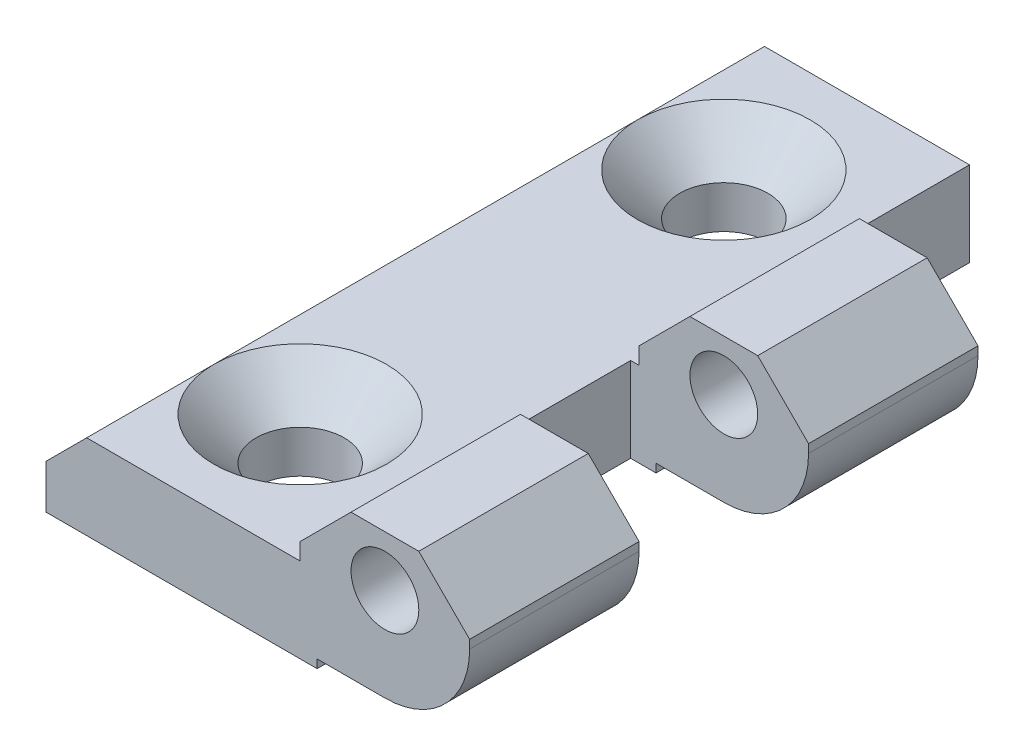
ISO-10303-21;
HEADER;
FILE_DESCRIPTION(('STEP AP214'),'2;1');
FILE_NAME('part.step','',(''),(''),'','','');
FILE_SCHEMA(('AUTOMOTIVE_DESIGN { 1 0 10303 214 1 1 1 1 }'));
ENDSEC;
DATA;
#1=APPLICATION_CONTEXT('core data for automotive mechanical design processes');
#2=APPLICATION_PROTOCOL_DEFINITION('international standard','automotive_design',2000,#1);
#3=PRODUCT_CONTEXT('',#1,'mechanical');
#4=PRODUCT('Part','Part','',(#3));
#5=PRODUCT_RELATED_PRODUCT_CATEGORY('part','',(#4));
#6=PRODUCT_DEFINITION_FORMATION('','',#4);
#7=PRODUCT_DEFINITION_CONTEXT('part definition',#1,'design');
#8=PRODUCT_DEFINITION('design','',#6,#7);
#9=PRODUCT_DEFINITION_SHAPE('','',#8);
#10=(LENGTH_UNIT() NAMED_UNIT(*) SI_UNIT(.MILLI.,.METRE.));
#11=(NAMED_UNIT(*) PLANE_ANGLE_UNIT() SI_UNIT($,.RADIAN.));
#12=(NAMED_UNIT(*) SI_UNIT($,.STERADIAN.) SOLID_ANGLE_UNIT());
#13=UNCERTAINTY_MEASURE_WITH_UNIT(LENGTH_MEASURE(1.E-05),#10,'distance_accuracy_value','');
#14=(GEOMETRIC_REPRESENTATION_CONTEXT(3) GLOBAL_UNCERTAINTY_ASSIGNED_CONTEXT((#13)) GLOBAL_UNIT_ASSIGNED_CONTEXT((#10,
#11,#12)) REPRESENTATION_CONTEXT('',''));
#15=CARTESIAN_POINT('',(0.,0.,0.));
#16=DIRECTION('',(0.,0.,1.));
#17=DIRECTION('',(1.,0.,0.));
#18=AXIS2_PLACEMENT_3D('',#15,#16,#17);
#19=CARTESIAN_POINT('',(-15.4752336448598,-9.99670301142266,40.));
#20=DIRECTION('',(-1.,0.,0.));
#21=DIRECTION('',(0.,-1.,0.));
#22=AXIS2_PLACEMENT_3D('',#19,#20,#21);
#23=PLANE('',#22);
#24=DIRECTION('',(0.,0.,-1.));
#25=VECTOR('',#24,1.);
#26=CARTESIAN_POINT('',(-15.4752336448598,-9.49670301142266,40.));
#27=LINE('',#26,#25);
#28=CARTESIAN_POINT('',(-15.4752336448598,-9.49670301142266,20.));
#29=VERTEX_POINT('',#28);
#30=CARTESIAN_POINT('',(-15.4752336448598,-9.49670301142266,9.99999999999999));
#31=VERTEX_POINT('',#30);
#32=EDGE_CURVE('E395',#29,#31,#27,.T.);
#33=ORIENTED_EDGE('',*,*,#32,.F.);
#34=DIRECTION('',(0.,-1.,0.));
#35=VECTOR('',#34,1.);
#36=CARTESIAN_POINT('',(-15.4752336448598,-9.99670301142266,20.));
#37=LINE('',#36,#35);
#38=CARTESIAN_POINT('',(-15.4752336448598,-9.99670301142276,20.));
#39=VERTEX_POINT('',#38);
#40=EDGE_CURVE('E278',#29,#39,#37,.T.);
#41=ORIENTED_EDGE('',*,*,#40,.T.);
#42=DIRECTION('',(0.,0.,-1.));
#43=VECTOR('',#42,1.);
#44=CARTESIAN_POINT('',(-15.4752336448598,-9.99670301142266,40.));
#45=LINE('',#44,#43);
#46=CARTESIAN_POINT('',(-15.4752336448598,-9.99670301142276,9.99999999999999));
#47=VERTEX_POINT('',#46);
#48=EDGE_CURVE('E399',#39,#47,#45,.T.);
#49=ORIENTED_EDGE('',*,*,#48,.T.);
#50=DIRECTION('',(0.,1.,0.));
#51=VECTOR('',#50,1.);
#52=CARTESIAN_POINT('',(-15.4752336448598,-9.99670301142266,9.99999999999999));
#53=LINE('',#52,#51);
#54=EDGE_CURVE('E317',#47,#31,#53,.T.);
#55=ORIENTED_EDGE('',*,*,#54,.T.);
#56=EDGE_LOOP('',(#33,#41,#49,#55));
#57=FACE_BOUND('',#56,.T.);
#58=ADVANCED_FACE('F33',(#57),#23,.F.);
#59=CARTESIAN_POINT('',(-15.4752336448598,-9.49670301142266,40.));
#60=DIRECTION('',(0.,1.,0.));
#61=DIRECTION('',(-1.,0.,0.));
#62=AXIS2_PLACEMENT_3D('',#59,#60,#61);
#63=PLANE('',#62);
#64=DIRECTION('',(0.,0.,-1.));
#65=VECTOR('',#64,1.);
#66=CARTESIAN_POINT('',(-11.4752336448598,-9.49670301142264,40.));
#67=LINE('',#66,#65);
#68=CARTESIAN_POINT('',(-11.4752336448598,-9.49670301142264,20.));
#69=VERTEX_POINT('',#68);
#70=CARTESIAN_POINT('',(-11.4752336448598,-9.49670301142264,9.99999999999999));
#71=VERTEX_POINT('',#70);
#72=EDGE_CURVE('E391',#69,#71,#67,.T.);
#73=ORIENTED_EDGE('',*,*,#72,.F.);
#74=DIRECTION('',(-1.,0.,0.));
#75=VECTOR('',#74,1.);
#76=CARTESIAN_POINT('',(-15.4752336448598,-9.49670301142266,20.));
#77=LINE('',#76,#75);
#78=EDGE_CURVE('E275',#69,#29,#77,.T.);
#79=ORIENTED_EDGE('',*,*,#78,.T.);
#80=ORIENTED_EDGE('',*,*,#32,.T.);
#81=DIRECTION('',(1.,0.,0.));
#82=VECTOR('',#81,1.);
#83=CARTESIAN_POINT('',(-15.4752336448598,-9.49670301142266,9.99999999999999));
#84=LINE('',#83,#82);
#85=EDGE_CURVE('E314',#31,#71,#84,.T.);
#86=ORIENTED_EDGE('',*,*,#85,.T.);
#87=EDGE_LOOP('',(#73,#79,#80,#86));
#88=FACE_BOUND('',#87,.T.);
#89=ADVANCED_FACE('F471',(#88),#63,.F.);
#90=CARTESIAN_POINT('',(-11.4752336448598,-4.49670301142263,40.));
#91=DIRECTION('',(0.,0.,-1.));
#92=DIRECTION('',(-1.,0.,0.));
#93=AXIS2_PLACEMENT_3D('',#90,#91,#92);
#94=CYLINDRICAL_SURFACE('',#93,5.00000000000002);
#95=DIRECTION('',(0.,0.,-1.));
#96=VECTOR('',#95,1.);
#97=CARTESIAN_POINT('',(-6.47523364485978,-4.49670301142256,40.));
#98=LINE('',#97,#96);
#99=CARTESIAN_POINT('',(-6.47523364485978,-4.49670301142256,20.));
#100=VERTEX_POINT('',#99);
#101=CARTESIAN_POINT('',(-6.47523364485978,-4.49670301142256,9.99999999999999));
#102=VERTEX_POINT('',#101);
#103=EDGE_CURVE('E387',#100,#102,#98,.T.);
#104=ORIENTED_EDGE('',*,*,#103,.F.);
#105=CARTESIAN_POINT('',(-11.4752336448598,-4.49670301142263,20.));
#106=DIRECTION('',(0.,0.,-1.));
#107=DIRECTION('',(-1.,0.,0.));
#108=AXIS2_PLACEMENT_3D('',#105,#106,#107);
#109=CIRCLE('',#108,5.00000000000002);
#110=EDGE_CURVE('E272',#100,#69,#109,.T.);
#111=ORIENTED_EDGE('',*,*,#110,.T.);
#112=ORIENTED_EDGE('',*,*,#72,.T.);
#113=CARTESIAN_POINT('',(-11.4752336448598,-4.49670301142263,9.99999999999999));
#114=DIRECTION('',(0.,0.,1.));
#115=DIRECTION('',(1.,0.,0.));
#116=AXIS2_PLACEMENT_3D('',#113,#114,#115);
#117=CIRCLE('',#116,5.00000000000002);
#118=EDGE_CURVE('E311',#71,#102,#117,.T.);
#119=ORIENTED_EDGE('',*,*,#118,.T.);
#120=EDGE_LOOP('',(#104,#111,#112,#119));
#121=FACE_BOUND('',#120,.T.);
#122=ADVANCED_FACE('F468',(#121),#94,.T.);
#123=CARTESIAN_POINT('',(-6.47523364485978,-4.49670301142256,40.));
#124=DIRECTION('',(-1.,0.,0.));
#125=DIRECTION('',(0.,-1.,0.));
#126=AXIS2_PLACEMENT_3D('',#123,#124,#125);
#127=PLANE('',#126);
#128=DIRECTION('',(0.,0.,-1.));
#129=VECTOR('',#128,1.);
#130=CARTESIAN_POINT('',(-6.47523364485978,-3.99670301142262,40.));
#131=LINE('',#130,#129);
#132=CARTESIAN_POINT('',(-6.47523364485978,-3.99670301142262,20.));
#133=VERTEX_POINT('',#132);
#134=CARTESIAN_POINT('',(-6.47523364485978,-3.99670301142262,9.99999999999999));
#135=VERTEX_POINT('',#134);
#136=EDGE_CURVE('E383',#133,#135,#131,.T.);
#137=ORIENTED_EDGE('',*,*,#136,.F.);
#138=DIRECTION('',(0.,-1.,0.));
#139=VECTOR('',#138,1.);
#140=CARTESIAN_POINT('',(-6.47523364485978,-4.49670301142256,20.));
#141=LINE('',#140,#139);
#142=EDGE_CURVE('E269',#133,#100,#141,.T.);
#143=ORIENTED_EDGE('',*,*,#142,.T.);
#144=ORIENTED_EDGE('',*,*,#103,.T.);
#145=DIRECTION('',(0.,1.,0.));
#146=VECTOR('',#145,1.);
#147=CARTESIAN_POINT('',(-6.47523364485978,-4.49670301142256,9.99999999999999));
#148=LINE('',#147,#146);
#149=EDGE_CURVE('E308',#102,#135,#148,.T.);
#150=ORIENTED_EDGE('',*,*,#149,.T.);
#151=EDGE_LOOP('',(#137,#143,#144,#150));
#152=FACE_BOUND('',#151,.T.);
#153=ADVANCED_FACE('F465',(#152),#127,.F.);
#154=CARTESIAN_POINT('',(-6.47523364485978,-3.99670301142262,40.));
#155=DIRECTION('',(-0.707106781186545,-0.70710678118655,0.));
#156=DIRECTION('',(0.70710678118655,-0.707106781186545,0.));
#157=AXIS2_PLACEMENT_3D('',#154,#155,#156);
#158=PLANE('',#157);
#159=DIRECTION('',(0.,0.,-1.));
#160=VECTOR('',#159,1.);
#161=CARTESIAN_POINT('',(-9.47523364485979,-0.996703011422631,40.));
#162=LINE('',#161,#160);
#163=CARTESIAN_POINT('',(-9.47523364485979,-0.996703011422568,20.));
#164=VERTEX_POINT('',#163);
#165=CARTESIAN_POINT('',(-9.47523364485979,-0.996703011422568,9.99999999999999));
#166=VERTEX_POINT('',#165);
#167=EDGE_CURVE('E379',#164,#166,#162,.T.);
#168=ORIENTED_EDGE('',*,*,#167,.F.);
#169=DIRECTION('',(0.70710678118655,-0.707106781186545,0.));
#170=VECTOR('',#169,1.);
#171=CARTESIAN_POINT('',(-6.47523364485978,-3.99670301142262,20.));
#172=LINE('',#171,#170);
#173=EDGE_CURVE('E266',#164,#133,#172,.T.);
#174=ORIENTED_EDGE('',*,*,#173,.T.);
#175=ORIENTED_EDGE('',*,*,#136,.T.);
#176=DIRECTION('',(-0.70710678118655,0.707106781186545,0.));
#177=VECTOR('',#176,1.);
#178=CARTESIAN_POINT('',(-6.47523364485978,-3.99670301142262,9.99999999999999));
#179=LINE('',#178,#177);
#180=EDGE_CURVE('E305',#135,#166,#179,.T.);
#181=ORIENTED_EDGE('',*,*,#180,.T.);
#182=EDGE_LOOP('',(#168,#174,#175,#181));
#183=FACE_BOUND('',#182,.T.);
#184=ADVANCED_FACE('F460',(#183),#158,.F.);
#185=CARTESIAN_POINT('',(-9.47523364485979,-0.996703011422631,40.));
#186=DIRECTION('',(0.,-1.,0.));
#187=DIRECTION('',(1.,0.,0.));
#188=AXIS2_PLACEMENT_3D('',#185,#186,#187);
#189=PLANE('',#188);
#190=DIRECTION('',(0.,0.,-1.));
#191=VECTOR('',#190,1.);
#192=CARTESIAN_POINT('',(-13.4752336448598,-0.996703011422645,40.));
#193=LINE('',#192,#191);
#194=CARTESIAN_POINT('',(-13.4752336448597,-0.99670301142258,20.));
#195=VERTEX_POINT('',#194);
#196=CARTESIAN_POINT('',(-13.4752336448597,-0.99670301142258,9.99999999999999));
#197=VERTEX_POINT('',#196);
#198=EDGE_CURVE('E375',#195,#197,#193,.T.);
#199=ORIENTED_EDGE('',*,*,#198,.F.);
#200=DIRECTION('',(-1.,0.,0.));
#201=VECTOR('',#200,1.);
#202=CARTESIAN_POINT('',(-9.47523364485979,-0.996703011422568,20.));
#203=LINE('',#202,#201);
#204=EDGE_CURVE('E226',#164,#195,#203,.T.);
#205=ORIENTED_EDGE('',*,*,#204,.F.);
#206=ORIENTED_EDGE('',*,*,#167,.T.);
#207=DIRECTION('',(1.,0.,0.));
#208=VECTOR('',#207,1.);
#209=CARTESIAN_POINT('',(-4.90971127807298,-0.996703011422554,9.99999999999999));
#210=LINE('',#209,#208);
#211=EDGE_CURVE('E281',#197,#166,#210,.T.);
#212=ORIENTED_EDGE('',*,*,#211,.F.);
#213=EDGE_LOOP('',(#199,#205,#206,#212));
#214=FACE_BOUND('',#213,.T.);
#215=ADVANCED_FACE('F456',(#214),#189,.F.);
#216=CARTESIAN_POINT('',(-13.4752336448598,-0.996703011422645,40.));
#217=DIRECTION('',(0.70710678118655,-0.707106781186545,0.));
#218=DIRECTION('',(0.707106781186545,0.70710678118655,0.));
#219=AXIS2_PLACEMENT_3D('',#216,#217,#218);
#220=PLANE('',#219);
#221=DIRECTION('',(0.,0.,-1.));
#222=VECTOR('',#221,1.);
#223=CARTESIAN_POINT('',(-16.4752336448598,-3.99670301142265,40.));
#224=LINE('',#223,#222);
#225=CARTESIAN_POINT('',(-16.4752336448598,-3.99670301142265,20.));
#226=VERTEX_POINT('',#225);
#227=CARTESIAN_POINT('',(-16.4752336448598,-3.99670301142265,9.99999999999999));
#228=VERTEX_POINT('',#227);
#229=EDGE_CURVE('E371',#226,#228,#224,.T.);
#230=ORIENTED_EDGE('',*,*,#229,.F.);
#231=DIRECTION('',(0.707106781186545,0.70710678118655,0.));
#232=VECTOR('',#231,1.);
#233=CARTESIAN_POINT('',(-13.4752336448598,-0.996703011422645,20.));
#234=LINE('',#233,#232);
#235=EDGE_CURVE('E263',#226,#195,#234,.T.);
#236=ORIENTED_EDGE('',*,*,#235,.T.);
#237=ORIENTED_EDGE('',*,*,#198,.T.);
#238=DIRECTION('',(-0.707106781186545,-0.70710678118655,0.));
#239=VECTOR('',#238,1.);
#240=CARTESIAN_POINT('',(-13.4752336448598,-0.996703011422645,9.99999999999999));
#241=LINE('',#240,#239);
#242=EDGE_CURVE('E302',#197,#228,#241,.T.);
#243=ORIENTED_EDGE('',*,*,#242,.T.);
#244=EDGE_LOOP('',(#230,#236,#237,#243));
#245=FACE_BOUND('',#244,.T.);
#246=ADVANCED_FACE('F451',(#245),#220,.F.);
#247=CARTESIAN_POINT('',(-16.4752336448598,-3.99670301142265,40.));
#248=DIRECTION('',(1.,0.,0.));
#249=DIRECTION('',(0.,1.,0.));
#250=AXIS2_PLACEMENT_3D('',#247,#248,#249);
#251=PLANE('',#250);
#252=DIRECTION('',(0.,0.,-1.));
#253=VECTOR('',#252,1.);
#254=CARTESIAN_POINT('',(-16.4752336448598,-4.99670301142265,40.));
#255=LINE('',#254,#253);
#256=CARTESIAN_POINT('',(-16.4752336448598,-4.99670301142265,20.));
#257=VERTEX_POINT('',#256);
#258=CARTESIAN_POINT('',(-16.4752336448598,-4.99670301142265,9.99999999999999));
#259=VERTEX_POINT('',#258);
#260=EDGE_CURVE('E366',#257,#259,#255,.T.);
#261=ORIENTED_EDGE('',*,*,#260,.F.);
#262=DIRECTION('',(0.,1.,0.));
#263=VECTOR('',#262,1.);
#264=CARTESIAN_POINT('',(-16.4752336448598,-3.99670301142265,20.));
#265=LINE('',#264,#263);
#266=EDGE_CURVE('E260',#257,#226,#265,.T.);
#267=ORIENTED_EDGE('',*,*,#266,.T.);
#268=ORIENTED_EDGE('',*,*,#229,.T.);
#269=DIRECTION('',(0.,-1.,0.));
#270=VECTOR('',#269,1.);
#271=CARTESIAN_POINT('',(-16.4752336448598,-3.99670301142265,9.99999999999999));
#272=LINE('',#271,#270);
#273=EDGE_CURVE('E299',#228,#259,#272,.T.);
#274=ORIENTED_EDGE('',*,*,#273,.T.);
#275=EDGE_LOOP('',(#261,#267,#268,#274));
#276=FACE_BOUND('',#275,.T.);
#277=ADVANCED_FACE('F420',(#276),#251,.F.);
#278=CARTESIAN_POINT('',(-11.4752336448598,-3.99670301142263,40.));
#279=DIRECTION('',(0.,0.,-1.));
#280=DIRECTION('',(-1.,0.,0.));
#281=AXIS2_PLACEMENT_3D('',#278,#279,#280);
#282=CYLINDRICAL_SURFACE('',#281,2.);
#283=CARTESIAN_POINT('',(-11.4752336448598,-3.99670301142263,20.));
#284=DIRECTION('',(0.,0.,-1.));
#285=DIRECTION('',(-1.,0.,0.));
#286=AXIS2_PLACEMENT_3D('',#283,#284,#285);
#287=CIRCLE('',#286,2.);
#288=CARTESIAN_POINT('',(-13.4752336448598,-3.99670301142263,20.));
#289=VERTEX_POINT('',#288);
#290=EDGE_CURVE('E256',#289,#289,#287,.T.);
#291=ORIENTED_EDGE('',*,*,#290,.F.);
#292=EDGE_LOOP('',(#291));
#293=FACE_BOUND('',#292,.T.);
#294=CARTESIAN_POINT('',(-11.4752336448598,-3.99670301142263,9.99999999999999));
#295=DIRECTION('',(0.,0.,1.));
#296=DIRECTION('',(1.,0.,0.));
#297=AXIS2_PLACEMENT_3D('',#294,#295,#296);
#298=CIRCLE('',#297,2.);
#299=CARTESIAN_POINT('',(-9.4752336448598,-3.99670301142263,9.99999999999999));
#300=VERTEX_POINT('',#299);
#301=EDGE_CURVE('E294',#300,#300,#298,.T.);
#302=ORIENTED_EDGE('',*,*,#301,.F.);
#303=EDGE_LOOP('',(#302));
#304=FACE_BOUND('',#303,.T.);
#305=ADVANCED_FACE('F416',(#293,#304),#282,.F.);
#306=CARTESIAN_POINT('',(-11.4752336448598,-4.49670301142263,40.));
#307=DIRECTION('',(0.,0.,1.));
#308=DIRECTION('',(1.,0.,0.));
#309=AXIS2_PLACEMENT_3D('',#306,#307,#308);
#310=PLANE('',#309);
#311=DIRECTION('',(0.,-1.,0.));
#312=VECTOR('',#311,1.);
#313=CARTESIAN_POINT('',(-31.4752336448598,-7.39670301142272,40.));
#314=LINE('',#313,#312);
#315=CARTESIAN_POINT('',(-31.4752336448598,-7.39670301142272,40.));
#316=VERTEX_POINT('',#315);
#317=CARTESIAN_POINT('',(-31.4752336448598,-9.99670301142273,40.));
#318=VERTEX_POINT('',#317);
#319=EDGE_CURVE('E324',#316,#318,#314,.T.);
#320=ORIENTED_EDGE('',*,*,#319,.T.);
#321=DIRECTION('',(1.,0.,0.));
#322=VECTOR('',#321,1.);
#323=CARTESIAN_POINT('',(-31.4752336448598,-9.99670301142273,40.));
#324=LINE('',#323,#322);
#325=CARTESIAN_POINT('',(-15.4752336448598,-9.99670301142266,40.));
#326=VERTEX_POINT('',#325);
#327=EDGE_CURVE('E327',#318,#326,#324,.T.);
#328=ORIENTED_EDGE('',*,*,#327,.T.);
#329=DIRECTION('',(0.,1.,0.));
#330=VECTOR('',#329,1.);
#331=CARTESIAN_POINT('',(-15.4752336448598,-9.99670301142266,40.));
#332=LINE('',#331,#330);
#333=CARTESIAN_POINT('',(-15.4752336448598,-9.49670301142266,40.));
#334=VERTEX_POINT('',#333);
#335=EDGE_CURVE('E330',#326,#334,#332,.T.);
#336=ORIENTED_EDGE('',*,*,#335,.T.);
#337=DIRECTION('',(1.,0.,0.));
#338=VECTOR('',#337,1.);
#339=CARTESIAN_POINT('',(-15.4752336448598,-9.49670301142266,40.));
#340=LINE('',#339,#338);
#341=CARTESIAN_POINT('',(-11.4752336448598,-9.49670301142264,40.));
#342=VERTEX_POINT('',#341);
#343=EDGE_CURVE('E332',#334,#342,#340,.T.);
#344=ORIENTED_EDGE('',*,*,#343,.T.);
#345=CARTESIAN_POINT('',(-11.4752336448598,-4.49670301142263,40.));
#346=DIRECTION('',(0.,0.,1.));
#347=DIRECTION('',(1.,0.,0.));
#348=AXIS2_PLACEMENT_3D('',#345,#346,#347);
#349=CIRCLE('',#348,5.00000000000002);
#350=CARTESIAN_POINT('',(-6.47523364485978,-4.49670301142256,40.));
#351=VERTEX_POINT('',#350);
#352=EDGE_CURVE('E334',#342,#351,#349,.T.);
#353=ORIENTED_EDGE('',*,*,#352,.T.);
#354=DIRECTION('',(0.,1.,0.));
#355=VECTOR('',#354,1.);
#356=CARTESIAN_POINT('',(-6.47523364485978,-4.49670301142256,40.));
#357=LINE('',#356,#355);
#358=CARTESIAN_POINT('',(-6.47523364485978,-3.99670301142262,40.));
#359=VERTEX_POINT('',#358);
#360=EDGE_CURVE('E336',#351,#359,#357,.T.);
#361=ORIENTED_EDGE('',*,*,#360,.T.);
#362=DIRECTION('',(-0.70710678118655,0.707106781186545,0.));
#363=VECTOR('',#362,1.);
#364=CARTESIAN_POINT('',(-6.47523364485978,-3.99670301142262,40.));
#365=LINE('',#364,#363);
#366=CARTESIAN_POINT('',(-9.47523364485979,-0.996703011422631,40.));
#367=VERTEX_POINT('',#366);
#368=EDGE_CURVE('E338',#359,#367,#365,.T.);
#369=ORIENTED_EDGE('',*,*,#368,.T.);
#370=DIRECTION('',(-1.,0.,0.));
#371=VECTOR('',#370,1.);
#372=CARTESIAN_POINT('',(-9.47523364485979,-0.996703011422631,40.));
#373=LINE('',#372,#371);
#374=CARTESIAN_POINT('',(-13.4752336448598,-0.996703011422645,40.));
#375=VERTEX_POINT('',#374);
#376=EDGE_CURVE('E340',#367,#375,#373,.T.);
#377=ORIENTED_EDGE('',*,*,#376,.T.);
#378=DIRECTION('',(-0.707106781186545,-0.70710678118655,0.));
#379=VECTOR('',#378,1.);
#380=CARTESIAN_POINT('',(-13.4752336448598,-0.996703011422645,40.));
#381=LINE('',#380,#379);
#382=CARTESIAN_POINT('',(-16.4752336448598,-3.99670301142265,40.));
#383=VERTEX_POINT('',#382);
#384=EDGE_CURVE('E342',#375,#383,#381,.T.);
#385=ORIENTED_EDGE('',*,*,#384,.T.);
#386=DIRECTION('',(0.,-1.,0.));
#387=VECTOR('',#386,1.);
#388=CARTESIAN_POINT('',(-16.4752336448598,-3.99670301142265,40.));
#389=LINE('',#388,#387);
#390=CARTESIAN_POINT('',(-16.4752336448598,-4.99670301142265,40.));
#391=VERTEX_POINT('',#390);
#392=EDGE_CURVE('E344',#383,#391,#389,.T.);
#393=ORIENTED_EDGE('',*,*,#392,.T.);
#394=DIRECTION('',(-1.,0.,0.));
#395=VECTOR('',#394,1.);
#396=CARTESIAN_POINT('',(-16.4752336448598,-4.99670301142265,40.));
#397=LINE('',#396,#395);
#398=CARTESIAN_POINT('',(-29.0752336448598,-4.99670301142271,40.));
#399=VERTEX_POINT('',#398);
#400=EDGE_CURVE('E346',#391,#399,#397,.T.);
#401=ORIENTED_EDGE('',*,*,#400,.T.);
#402=DIRECTION('',(-0.707106781186544,-0.707106781186551,0.));
#403=VECTOR('',#402,1.);
#404=CARTESIAN_POINT('',(-29.0752336448598,-4.99670301142271,40.));
#405=LINE('',#404,#403);
#406=EDGE_CURVE('E348',#399,#316,#405,.T.);
#407=ORIENTED_EDGE('',*,*,#406,.T.);
#408=EDGE_LOOP('',(#320,#328,#336,#344,#353,#361,#369,#377,#385,#393,#401,#407));
#409=FACE_BOUND('',#408,.T.);
#410=CARTESIAN_POINT('',(-11.4752336448598,-3.99670301142263,40.));
#411=DIRECTION('',(0.,0.,1.));
#412=DIRECTION('',(1.,0.,0.));
#413=AXIS2_PLACEMENT_3D('',#410,#411,#412);
#414=CIRCLE('',#413,2.);
#415=CARTESIAN_POINT('',(-9.4752336448598,-3.99670301142263,40.));
#416=VERTEX_POINT('',#415);
#417=EDGE_CURVE('E320',#416,#416,#414,.T.);
#418=ORIENTED_EDGE('',*,*,#417,.F.);
#419=EDGE_LOOP('',(#418));
#420=FACE_BOUND('',#419,.T.);
#421=ADVANCED_FACE('F419',(#409,#420),#310,.T.);
#422=CARTESIAN_POINT('',(-11.4752336448598,-4.49670301142263,0.));
#423=DIRECTION('',(0.,0.,1.));
#424=DIRECTION('',(1.,0.,0.));
#425=AXIS2_PLACEMENT_3D('',#422,#423,#424);
#426=PLANE('',#425);
#427=DIRECTION('',(-1.,0.,0.));
#428=VECTOR('',#427,1.);
#429=CARTESIAN_POINT('',(-16.4752336448598,-4.99670301142265,0.));
#430=LINE('',#429,#428);
#431=CARTESIAN_POINT('',(-16.9752336448598,-4.99670301142265,0.));
#432=VERTEX_POINT('',#431);
#433=CARTESIAN_POINT('',(-29.0752336448598,-4.99670301142271,0.));
#434=VERTEX_POINT('',#433);
#435=EDGE_CURVE('E356',#432,#434,#430,.T.);
#436=ORIENTED_EDGE('',*,*,#435,.F.);
#437=DIRECTION('',(0.,1.,0.));
#438=VECTOR('',#437,1.);
#439=CARTESIAN_POINT('',(-16.9752336448598,-9.99670301142276,0.));
#440=LINE('',#439,#438);
#441=CARTESIAN_POINT('',(-16.9752336448598,-9.99670301142276,0.));
#442=VERTEX_POINT('',#441);
#443=EDGE_CURVE('E290',#442,#432,#440,.T.);
#444=ORIENTED_EDGE('',*,*,#443,.F.);
#445=DIRECTION('',(1.,0.,0.));
#446=VECTOR('',#445,1.);
#447=CARTESIAN_POINT('',(-31.4752336448598,-9.99670301142273,0.));
#448=LINE('',#447,#446);
#449=CARTESIAN_POINT('',(-31.4752336448598,-9.99670301142273,0.));
#450=VERTEX_POINT('',#449);
#451=EDGE_CURVE('E353',#450,#442,#448,.T.);
#452=ORIENTED_EDGE('',*,*,#451,.F.);
#453=DIRECTION('',(0.,-1.,0.));
#454=VECTOR('',#453,1.);
#455=CARTESIAN_POINT('',(-31.4752336448598,-7.39670301142272,0.));
#456=LINE('',#455,#454);
#457=CARTESIAN_POINT('',(-31.4752336448598,-7.39670301142272,0.));
#458=VERTEX_POINT('',#457);
#459=EDGE_CURVE('E323',#458,#450,#456,.T.);
#460=ORIENTED_EDGE('',*,*,#459,.F.);
#461=DIRECTION('',(-0.707106781186544,-0.707106781186551,0.));
#462=VECTOR('',#461,1.);
#463=CARTESIAN_POINT('',(-29.0752336448598,-4.99670301142271,0.));
#464=LINE('',#463,#462);
#465=EDGE_CURVE('E328',#434,#458,#464,.T.);
#466=ORIENTED_EDGE('',*,*,#465,.F.);
#467=EDGE_LOOP('',(#436,#444,#452,#460,#466));
#468=FACE_BOUND('',#467,.T.);
#469=ADVANCED_FACE('F440',(#468),#426,.F.);
#470=CARTESIAN_POINT('',(-31.4752336448598,-7.39670301142272,40.));
#471=DIRECTION('',(1.,0.,0.));
#472=DIRECTION('',(0.,1.,0.));
#473=AXIS2_PLACEMENT_3D('',#470,#471,#472);
#474=PLANE('',#473);
#475=ORIENTED_EDGE('',*,*,#459,.T.);
#476=DIRECTION('',(0.,0.,-1.));
#477=VECTOR('',#476,1.);
#478=CARTESIAN_POINT('',(-31.4752336448598,-9.99670301142273,40.));
#479=LINE('',#478,#477);
#480=EDGE_CURVE('E402',#318,#450,#479,.T.);
#481=ORIENTED_EDGE('',*,*,#480,.F.);
#482=ORIENTED_EDGE('',*,*,#319,.F.);
#483=DIRECTION('',(0.,0.,-1.));
#484=VECTOR('',#483,1.);
#485=CARTESIAN_POINT('',(-31.4752336448598,-7.39670301142272,40.));
#486=LINE('',#485,#484);
#487=EDGE_CURVE('E350',#316,#458,#486,.T.);
#488=ORIENTED_EDGE('',*,*,#487,.T.);
#489=EDGE_LOOP('',(#475,#481,#482,#488));
#490=FACE_BOUND('',#489,.T.);
#491=ADVANCED_FACE('F35',(#490),#474,.F.);
#492=CARTESIAN_POINT('',(-31.4752336448598,-9.99670301142273,40.));
#493=DIRECTION('',(0.,1.,0.));
#494=DIRECTION('',(-1.,0.,0.));
#495=AXIS2_PLACEMENT_3D('',#492,#493,#494);
#496=PLANE('',#495);
#497=CARTESIAN_POINT('',(-23.9752336448598,-9.99670301142279,7.5));
#498=DIRECTION('',(0.,1.,0.));
#499=DIRECTION('',(0.,0.,1.));
#500=AXIS2_PLACEMENT_3D('',#497,#498,#499);
#501=CIRCLE('',#500,2.6);
#502=CARTESIAN_POINT('',(-23.9752336448598,-9.99670301142279,10.1));
#503=VERTEX_POINT('',#502);
#504=EDGE_CURVE('E502',#503,#503,#501,.T.);
#505=ORIENTED_EDGE('',*,*,#504,.T.);
#506=EDGE_LOOP('',(#505));
#507=FACE_BOUND('',#506,.T.);
#508=CARTESIAN_POINT('',(-23.9752336448598,-9.99670301142279,32.5));
#509=DIRECTION('',(0.,1.,0.));
#510=DIRECTION('',(0.,0.,1.));
#511=AXIS2_PLACEMENT_3D('',#508,#509,#510);
#512=CIRCLE('',#511,2.6);
#513=CARTESIAN_POINT('',(-23.9752336448598,-9.99670301142279,35.1));
#514=VERTEX_POINT('',#513);
#515=EDGE_CURVE('E495',#514,#514,#512,.T.);
#516=ORIENTED_EDGE('',*,*,#515,.T.);
#517=EDGE_LOOP('',(#516));
#518=FACE_BOUND('',#517,.T.);
#519=ORIENTED_EDGE('',*,*,#48,.F.);
#520=DIRECTION('',(-1.,0.,0.));
#521=VECTOR('',#520,1.);
#522=CARTESIAN_POINT('',(-9.47523364485977,-9.99670301142274,20.));
#523=LINE('',#522,#521);
#524=CARTESIAN_POINT('',(-16.9752336448598,-9.99670301142276,20.));
#525=VERTEX_POINT('',#524);
#526=EDGE_CURVE('E213',#39,#525,#523,.T.);
#527=ORIENTED_EDGE('',*,*,#526,.T.);
#528=DIRECTION('',(0.,0.,1.));
#529=VECTOR('',#528,1.);
#530=CARTESIAN_POINT('',(-16.9752336448598,-9.99670301142276,28.700140492334));
#531=LINE('',#530,#529);
#532=CARTESIAN_POINT('',(-16.9752336448598,-9.99670301142276,30.));
#533=VERTEX_POINT('',#532);
#534=EDGE_CURVE('E208',#525,#533,#531,.T.);
#535=ORIENTED_EDGE('',*,*,#534,.T.);
#536=DIRECTION('',(1.,0.,0.));
#537=VECTOR('',#536,1.);
#538=CARTESIAN_POINT('',(-3.07313033209124,-9.99670301142272,30.));
#539=LINE('',#538,#537);
#540=CARTESIAN_POINT('',(-15.4752336448598,-9.99670301142276,30.));
#541=VERTEX_POINT('',#540);
#542=EDGE_CURVE('E216',#533,#541,#539,.T.);
#543=ORIENTED_EDGE('',*,*,#542,.T.);
#544=EDGE_CURVE('E400',#326,#541,#45,.T.);
#545=ORIENTED_EDGE('',*,*,#544,.F.);
#546=ORIENTED_EDGE('',*,*,#327,.F.);
#547=ORIENTED_EDGE('',*,*,#480,.T.);
#548=ORIENTED_EDGE('',*,*,#451,.T.);
#549=DIRECTION('',(0.,0.,1.));
#550=VECTOR('',#549,1.);
#551=CARTESIAN_POINT('',(-16.9752336448598,-9.99670301142276,9.99999999999999));
#552=LINE('',#551,#550);
#553=CARTESIAN_POINT('',(-16.9752336448598,-9.99670301142276,9.99999999999999));
#554=VERTEX_POINT('',#553);
#555=EDGE_CURVE('E287',#442,#554,#552,.T.);
#556=ORIENTED_EDGE('',*,*,#555,.T.);
#557=DIRECTION('',(1.,0.,0.));
#558=VECTOR('',#557,1.);
#559=CARTESIAN_POINT('',(-4.90971127807296,-9.99670301142273,9.99999999999999));
#560=LINE('',#559,#558);
#561=EDGE_CURVE('E284',#554,#47,#560,.T.);
#562=ORIENTED_EDGE('',*,*,#561,.T.);
#563=EDGE_LOOP('',(#519,#527,#535,#543,#545,#546,#547,#548,#556,#562));
#564=FACE_BOUND('',#563,.T.);
#565=ADVANCED_FACE('F225',(#507,#518,#564),#496,.F.);
#566=ORIENTED_EDGE('',*,*,#544,.T.);
#567=DIRECTION('',(0.,1.,0.));
#568=VECTOR('',#567,1.);
#569=CARTESIAN_POINT('',(-15.4752336448598,-9.99670301142266,30.));
#570=LINE('',#569,#568);
#571=CARTESIAN_POINT('',(-15.4752336448598,-9.49670301142266,30.));
#572=VERTEX_POINT('',#571);
#573=EDGE_CURVE('E219',#541,#572,#570,.T.);
#574=ORIENTED_EDGE('',*,*,#573,.T.);
#575=EDGE_CURVE('E396',#334,#572,#27,.T.);
#576=ORIENTED_EDGE('',*,*,#575,.F.);
#577=ORIENTED_EDGE('',*,*,#335,.F.);
#578=EDGE_LOOP('',(#566,#574,#576,#577));
#579=FACE_BOUND('',#578,.T.);
#580=ADVANCED_FACE('F526',(#579),#23,.F.);
#581=ORIENTED_EDGE('',*,*,#575,.T.);
#582=DIRECTION('',(1.,0.,0.));
#583=VECTOR('',#582,1.);
#584=CARTESIAN_POINT('',(-15.4752336448598,-9.49670301142266,30.));
#585=LINE('',#584,#583);
#586=CARTESIAN_POINT('',(-11.4752336448598,-9.49670301142264,30.));
#587=VERTEX_POINT('',#586);
#588=EDGE_CURVE('E252',#572,#587,#585,.T.);
#589=ORIENTED_EDGE('',*,*,#588,.T.);
#590=EDGE_CURVE('E392',#342,#587,#67,.T.);
#591=ORIENTED_EDGE('',*,*,#590,.F.);
#592=ORIENTED_EDGE('',*,*,#343,.F.);
#593=EDGE_LOOP('',(#581,#589,#591,#592));
#594=FACE_BOUND('',#593,.T.);
#595=ADVANCED_FACE('F531',(#594),#63,.F.);
#596=ORIENTED_EDGE('',*,*,#590,.T.);
#597=CARTESIAN_POINT('',(-11.4752336448598,-4.49670301142263,30.));
#598=DIRECTION('',(0.,0.,1.));
#599=DIRECTION('',(1.,0.,0.));
#600=AXIS2_PLACEMENT_3D('',#597,#598,#599);
#601=CIRCLE('',#600,5.00000000000002);
#602=CARTESIAN_POINT('',(-6.47523364485978,-4.49670301142256,30.));
#603=VERTEX_POINT('',#602);
#604=EDGE_CURVE('E249',#587,#603,#601,.T.);
#605=ORIENTED_EDGE('',*,*,#604,.T.);
#606=EDGE_CURVE('E388',#351,#603,#98,.T.);
#607=ORIENTED_EDGE('',*,*,#606,.F.);
#608=ORIENTED_EDGE('',*,*,#352,.F.);
#609=EDGE_LOOP('',(#596,#605,#607,#608));
#610=FACE_BOUND('',#609,.T.);
#611=ADVANCED_FACE('F538',(#610),#94,.T.);
#612=ORIENTED_EDGE('',*,*,#606,.T.);
#613=DIRECTION('',(0.,1.,0.));
#614=VECTOR('',#613,1.);
#615=CARTESIAN_POINT('',(-6.47523364485978,-4.49670301142256,30.));
#616=LINE('',#615,#614);
#617=CARTESIAN_POINT('',(-6.47523364485978,-3.99670301142262,30.));
#618=VERTEX_POINT('',#617);
#619=EDGE_CURVE('E246',#603,#618,#616,.T.);
#620=ORIENTED_EDGE('',*,*,#619,.T.);
#621=EDGE_CURVE('E384',#359,#618,#131,.T.);
#622=ORIENTED_EDGE('',*,*,#621,.F.);
#623=ORIENTED_EDGE('',*,*,#360,.F.);
#624=EDGE_LOOP('',(#612,#620,#622,#623));
#625=FACE_BOUND('',#624,.T.);
#626=ADVANCED_FACE('F559',(#625),#127,.F.);
#627=ORIENTED_EDGE('',*,*,#621,.T.);
#628=DIRECTION('',(-0.70710678118655,0.707106781186545,0.));
#629=VECTOR('',#628,1.);
#630=CARTESIAN_POINT('',(-6.47523364485978,-3.99670301142262,30.));
#631=LINE('',#630,#629);
#632=CARTESIAN_POINT('',(-9.47523364485979,-0.996703011422567,30.));
#633=VERTEX_POINT('',#632);
#634=EDGE_CURVE('E243',#618,#633,#631,.T.);
#635=ORIENTED_EDGE('',*,*,#634,.T.);
#636=EDGE_CURVE('E380',#367,#633,#162,.T.);
#637=ORIENTED_EDGE('',*,*,#636,.F.);
#638=ORIENTED_EDGE('',*,*,#368,.F.);
#639=EDGE_LOOP('',(#627,#635,#637,#638));
#640=FACE_BOUND('',#639,.T.);
#641=ADVANCED_FACE('F557',(#640),#158,.F.);
#642=ORIENTED_EDGE('',*,*,#636,.T.);
#643=DIRECTION('',(1.,0.,0.));
#644=VECTOR('',#643,1.);
#645=CARTESIAN_POINT('',(-3.07313033209127,-0.996703011422548,30.));
#646=LINE('',#645,#644);
#647=CARTESIAN_POINT('',(-13.4752336448597,-0.996703011422579,30.));
#648=VERTEX_POINT('',#647);
#649=EDGE_CURVE('E228',#648,#633,#646,.T.);
#650=ORIENTED_EDGE('',*,*,#649,.F.);
#651=EDGE_CURVE('E376',#375,#648,#193,.T.);
#652=ORIENTED_EDGE('',*,*,#651,.F.);
#653=ORIENTED_EDGE('',*,*,#376,.F.);
#654=EDGE_LOOP('',(#642,#650,#652,#653));
#655=FACE_BOUND('',#654,.T.);
#656=ADVANCED_FACE('F487',(#655),#189,.F.);
#657=ORIENTED_EDGE('',*,*,#651,.T.);
#658=DIRECTION('',(-0.707106781186545,-0.70710678118655,0.));
#659=VECTOR('',#658,1.);
#660=CARTESIAN_POINT('',(-13.4752336448598,-0.996703011422646,30.));
#661=LINE('',#660,#659);
#662=CARTESIAN_POINT('',(-16.4752336448598,-3.99670301142265,30.));
#663=VERTEX_POINT('',#662);
#664=EDGE_CURVE('E240',#648,#663,#661,.T.);
#665=ORIENTED_EDGE('',*,*,#664,.T.);
#666=EDGE_CURVE('E372',#383,#663,#224,.T.);
#667=ORIENTED_EDGE('',*,*,#666,.F.);
#668=ORIENTED_EDGE('',*,*,#384,.F.);
#669=EDGE_LOOP('',(#657,#665,#667,#668));
#670=FACE_BOUND('',#669,.T.);
#671=ADVANCED_FACE('F483',(#670),#220,.F.);
#672=ORIENTED_EDGE('',*,*,#666,.T.);
#673=DIRECTION('',(0.,-1.,0.));
#674=VECTOR('',#673,1.);
#675=CARTESIAN_POINT('',(-16.4752336448598,-3.99670301142265,30.));
#676=LINE('',#675,#674);
#677=CARTESIAN_POINT('',(-16.4752336448598,-4.99670301142265,30.));
#678=VERTEX_POINT('',#677);
#679=EDGE_CURVE('E237',#663,#678,#676,.T.);
#680=ORIENTED_EDGE('',*,*,#679,.T.);
#681=EDGE_CURVE('E368',#391,#678,#255,.T.);
#682=ORIENTED_EDGE('',*,*,#681,.F.);
#683=ORIENTED_EDGE('',*,*,#392,.F.);
#684=EDGE_LOOP('',(#672,#680,#682,#683));
#685=FACE_BOUND('',#684,.T.);
#686=ADVANCED_FACE('F478',(#685),#251,.F.);
#687=CARTESIAN_POINT('',(-16.4752336448598,-4.99670301142265,40.));
#688=DIRECTION('',(0.,-1.,0.));
#689=DIRECTION('',(1.,0.,0.));
#690=AXIS2_PLACEMENT_3D('',#687,#688,#689);
#691=PLANE('',#690);
#692=DIRECTION('',(0.,0.,-1.));
#693=VECTOR('',#692,1.);
#694=CARTESIAN_POINT('',(-29.0752336448598,-4.99670301142271,40.));
#695=LINE('',#694,#693);
#696=CARTESIAN_POINT('',(-29.0752336448598,-4.99670301142271,7.5));
#697=VERTEX_POINT('',#696);
#698=EDGE_CURVE('E362',#697,#434,#695,.T.);
#699=ORIENTED_EDGE('',*,*,#698,.F.);
#700=CARTESIAN_POINT('',(-23.9752336448598,-4.99670301142268,7.5));
#701=DIRECTION('',(0.,1.,0.));
#702=DIRECTION('',(0.,0.,1.));
#703=AXIS2_PLACEMENT_3D('',#700,#701,#702);
#704=CIRCLE('',#703,5.1);
#705=EDGE_CURVE('E46',#697,#697,#704,.T.);
#706=ORIENTED_EDGE('',*,*,#705,.F.);
#707=CARTESIAN_POINT('',(-29.0752336448598,-4.99670301142271,32.5));
#708=VERTEX_POINT('',#707);
#709=EDGE_CURVE('E367',#708,#697,#695,.T.);
#710=ORIENTED_EDGE('',*,*,#709,.F.);
#711=CARTESIAN_POINT('',(-23.9752336448598,-4.99670301142268,32.5));
#712=DIRECTION('',(0.,1.,0.));
#713=DIRECTION('',(0.,0.,1.));
#714=AXIS2_PLACEMENT_3D('',#711,#712,#713);
#715=CIRCLE('',#714,5.1);
#716=EDGE_CURVE('E51',#708,#708,#715,.T.);
#717=ORIENTED_EDGE('',*,*,#716,.F.);
#718=EDGE_CURVE('E363',#399,#708,#695,.T.);
#719=ORIENTED_EDGE('',*,*,#718,.F.);
#720=ORIENTED_EDGE('',*,*,#400,.F.);
#721=ORIENTED_EDGE('',*,*,#681,.T.);
#722=DIRECTION('',(-1.,0.,0.));
#723=VECTOR('',#722,1.);
#724=CARTESIAN_POINT('',(-16.4752336448598,-4.99670301142265,30.));
#725=LINE('',#724,#723);
#726=CARTESIAN_POINT('',(-16.9752336448598,-4.99670301142265,30.));
#727=VERTEX_POINT('',#726);
#728=EDGE_CURVE('E235',#678,#727,#725,.T.);
#729=ORIENTED_EDGE('',*,*,#728,.T.);
#730=DIRECTION('',(0.,0.,-1.));
#731=VECTOR('',#730,1.);
#732=CARTESIAN_POINT('',(-16.9752336448598,-4.99670301142265,40.));
#733=LINE('',#732,#731);
#734=CARTESIAN_POINT('',(-16.9752336448598,-4.99670301142265,20.));
#735=VERTEX_POINT('',#734);
#736=EDGE_CURVE('E11',#727,#735,#733,.T.);
#737=ORIENTED_EDGE('',*,*,#736,.T.);
#738=DIRECTION('',(1.,0.,0.));
#739=VECTOR('',#738,1.);
#740=CARTESIAN_POINT('',(-16.4752336448598,-4.99670301142265,20.));
#741=LINE('',#740,#739);
#742=EDGE_CURVE('E257',#735,#257,#741,.T.);
#743=ORIENTED_EDGE('',*,*,#742,.T.);
#744=ORIENTED_EDGE('',*,*,#260,.T.);
#745=DIRECTION('',(-1.,0.,0.));
#746=VECTOR('',#745,1.);
#747=CARTESIAN_POINT('',(-16.4752336448598,-4.99670301142265,9.99999999999999));
#748=LINE('',#747,#746);
#749=CARTESIAN_POINT('',(-16.9752336448598,-4.99670301142265,9.99999999999999));
#750=VERTEX_POINT('',#749);
#751=EDGE_CURVE('E296',#259,#750,#748,.T.);
#752=ORIENTED_EDGE('',*,*,#751,.T.);
#753=DIRECTION('',(0.,0.,-1.));
#754=VECTOR('',#753,1.);
#755=CARTESIAN_POINT('',(-16.9752336448598,-4.99670301142265,40.));
#756=LINE('',#755,#754);
#757=EDGE_CURVE('E41',#750,#432,#756,.T.);
#758=ORIENTED_EDGE('',*,*,#757,.T.);
#759=ORIENTED_EDGE('',*,*,#435,.T.);
#760=EDGE_LOOP('',(#699,#706,#710,#717,#719,#720,#721,#729,#737,#743,#744,#752,#758,#759));
#761=FACE_BOUND('',#760,.T.);
#762=ADVANCED_FACE('F444',(#761),#691,.F.);
#763=CARTESIAN_POINT('',(-29.0752336448598,-4.99670301142271,40.));
#764=DIRECTION('',(0.707106781186551,-0.707106781186544,0.));
#765=DIRECTION('',(0.707106781186544,0.707106781186551,0.));
#766=AXIS2_PLACEMENT_3D('',#763,#764,#765);
#767=PLANE('',#766);
#768=ORIENTED_EDGE('',*,*,#465,.T.);
#769=ORIENTED_EDGE('',*,*,#487,.F.);
#770=ORIENTED_EDGE('',*,*,#406,.F.);
#771=ORIENTED_EDGE('',*,*,#718,.T.);
#772=ORIENTED_EDGE('',*,*,#709,.T.);
#773=ORIENTED_EDGE('',*,*,#698,.T.);
#774=EDGE_LOOP('',(#768,#769,#770,#771,#772,#773));
#775=FACE_BOUND('',#774,.T.);
#776=ADVANCED_FACE('F549',(#775),#767,.F.);
#777=CARTESIAN_POINT('',(-11.4752336448598,-3.99670301142263,30.));
#778=DIRECTION('',(0.,0.,1.));
#779=DIRECTION('',(1.,0.,0.));
#780=AXIS2_PLACEMENT_3D('',#777,#778,#779);
#781=CIRCLE('',#780,2.);
#782=CARTESIAN_POINT('',(-9.4752336448598,-3.99670301142263,30.));
#783=VERTEX_POINT('',#782);
#784=EDGE_CURVE('E233',#783,#783,#781,.T.);
#785=ORIENTED_EDGE('',*,*,#784,.F.);
#786=EDGE_LOOP('',(#785));
#787=FACE_BOUND('',#786,.T.);
#788=ORIENTED_EDGE('',*,*,#417,.T.);
#789=EDGE_LOOP('',(#788));
#790=FACE_BOUND('',#789,.T.);
#791=ADVANCED_FACE('F422',(#787,#790),#282,.F.);
#792=CARTESIAN_POINT('',(-16.9752336448598,-9.99670301142276,9.99999999999999));
#793=DIRECTION('',(-1.,0.,0.));
#794=DIRECTION('',(0.,-1.,0.));
#795=AXIS2_PLACEMENT_3D('',#792,#793,#794);
#796=PLANE('',#795);
#797=DIRECTION('',(0.,1.,0.));
#798=VECTOR('',#797,1.);
#799=CARTESIAN_POINT('',(-16.9752336448598,-9.99670301142276,9.99999999999999));
#800=LINE('',#799,#798);
#801=EDGE_CURVE('E291',#554,#750,#800,.T.);
#802=ORIENTED_EDGE('',*,*,#801,.F.);
#803=ORIENTED_EDGE('',*,*,#555,.F.);
#804=ORIENTED_EDGE('',*,*,#443,.T.);
#805=ORIENTED_EDGE('',*,*,#757,.F.);
#806=EDGE_LOOP('',(#802,#803,#804,#805));
#807=FACE_BOUND('',#806,.T.);
#808=ADVANCED_FACE('F428',(#807),#796,.F.);
#809=CARTESIAN_POINT('',(-9.47523364485976,-9.99670301142274,9.99999999999999));
#810=DIRECTION('',(0.,0.,1.));
#811=DIRECTION('',(1.,0.,0.));
#812=AXIS2_PLACEMENT_3D('',#809,#810,#811);
#813=PLANE('',#812);
#814=ORIENTED_EDGE('',*,*,#301,.T.);
#815=EDGE_LOOP('',(#814));
#816=FACE_BOUND('',#815,.T.);
#817=ORIENTED_EDGE('',*,*,#561,.F.);
#818=ORIENTED_EDGE('',*,*,#801,.T.);
#819=ORIENTED_EDGE('',*,*,#751,.F.);
#820=ORIENTED_EDGE('',*,*,#273,.F.);
#821=ORIENTED_EDGE('',*,*,#242,.F.);
#822=ORIENTED_EDGE('',*,*,#211,.T.);
#823=ORIENTED_EDGE('',*,*,#180,.F.);
#824=ORIENTED_EDGE('',*,*,#149,.F.);
#825=ORIENTED_EDGE('',*,*,#118,.F.);
#826=ORIENTED_EDGE('',*,*,#85,.F.);
#827=ORIENTED_EDGE('',*,*,#54,.F.);
#828=EDGE_LOOP('',(#817,#818,#819,#820,#821,#822,#823,#824,#825,#826,#827));
#829=FACE_BOUND('',#828,.T.);
#830=ADVANCED_FACE('F425',(#816,#829),#813,.F.);
#831=CARTESIAN_POINT('',(-16.9752336448598,-9.99670301142276,30.));
#832=DIRECTION('',(-1.,0.,0.));
#833=DIRECTION('',(0.,-1.,0.));
#834=AXIS2_PLACEMENT_3D('',#831,#832,#833);
#835=PLANE('',#834);
#836=DIRECTION('',(0.,1.,0.));
#837=VECTOR('',#836,1.);
#838=CARTESIAN_POINT('',(-16.9752336448598,-9.99670301142276,30.));
#839=LINE('',#838,#837);
#840=EDGE_CURVE('E204',#533,#727,#839,.T.);
#841=ORIENTED_EDGE('',*,*,#840,.F.);
#842=ORIENTED_EDGE('',*,*,#534,.F.);
#843=DIRECTION('',(0.,1.,0.));
#844=VECTOR('',#843,1.);
#845=CARTESIAN_POINT('',(-16.9752336448598,-9.99670301142276,20.));
#846=LINE('',#845,#844);
#847=EDGE_CURVE('E212',#525,#735,#846,.T.);
#848=ORIENTED_EDGE('',*,*,#847,.T.);
#849=ORIENTED_EDGE('',*,*,#736,.F.);
#850=EDGE_LOOP('',(#841,#842,#848,#849));
#851=FACE_BOUND('',#850,.T.);
#852=ADVANCED_FACE('F206',(#851),#835,.F.);
#853=CARTESIAN_POINT('',(-9.47523364485977,-9.99670301142274,20.));
#854=DIRECTION('',(0.,0.,-1.));
#855=DIRECTION('',(-1.,0.,0.));
#856=AXIS2_PLACEMENT_3D('',#853,#854,#855);
#857=PLANE('',#856);
#858=ORIENTED_EDGE('',*,*,#290,.T.);
#859=EDGE_LOOP('',(#858));
#860=FACE_BOUND('',#859,.T.);
#861=ORIENTED_EDGE('',*,*,#78,.F.);
#862=ORIENTED_EDGE('',*,*,#110,.F.);
#863=ORIENTED_EDGE('',*,*,#142,.F.);
#864=ORIENTED_EDGE('',*,*,#173,.F.);
#865=ORIENTED_EDGE('',*,*,#204,.T.);
#866=ORIENTED_EDGE('',*,*,#235,.F.);
#867=ORIENTED_EDGE('',*,*,#266,.F.);
#868=ORIENTED_EDGE('',*,*,#742,.F.);
#869=ORIENTED_EDGE('',*,*,#847,.F.);
#870=ORIENTED_EDGE('',*,*,#526,.F.);
#871=ORIENTED_EDGE('',*,*,#40,.F.);
#872=EDGE_LOOP('',(#861,#862,#863,#864,#865,#866,#867,#868,#869,#870,#871));
#873=FACE_BOUND('',#872,.T.);
#874=ADVANCED_FACE('F413',(#860,#873),#857,.F.);
#875=CARTESIAN_POINT('',(-3.07313033209124,-9.99670301142272,30.));
#876=DIRECTION('',(0.,0.,1.));
#877=DIRECTION('',(1.,0.,0.));
#878=AXIS2_PLACEMENT_3D('',#875,#876,#877);
#879=PLANE('',#878);
#880=ORIENTED_EDGE('',*,*,#784,.T.);
#881=EDGE_LOOP('',(#880));
#882=FACE_BOUND('',#881,.T.);
#883=ORIENTED_EDGE('',*,*,#542,.F.);
#884=ORIENTED_EDGE('',*,*,#840,.T.);
#885=ORIENTED_EDGE('',*,*,#728,.F.);
#886=ORIENTED_EDGE('',*,*,#679,.F.);
#887=ORIENTED_EDGE('',*,*,#664,.F.);
#888=ORIENTED_EDGE('',*,*,#649,.T.);
#889=ORIENTED_EDGE('',*,*,#634,.F.);
#890=ORIENTED_EDGE('',*,*,#619,.F.);
#891=ORIENTED_EDGE('',*,*,#604,.F.);
#892=ORIENTED_EDGE('',*,*,#588,.F.);
#893=ORIENTED_EDGE('',*,*,#573,.F.);
#894=EDGE_LOOP('',(#883,#884,#885,#886,#887,#888,#889,#890,#891,#892,#893));
#895=FACE_BOUND('',#894,.T.);
#896=ADVANCED_FACE('F217',(#882,#895),#879,.F.);
#897=CARTESIAN_POINT('',(-23.9752336448598,-4.99670301142268,32.5));
#898=DIRECTION('',(0.,1.,0.));
#899=DIRECTION('',(0.,0.,1.));
#900=AXIS2_PLACEMENT_3D('',#897,#898,#899);
#901=CONICAL_SURFACE('',#900,5.1,0.785398163397449);
#902=CARTESIAN_POINT('',(-23.9752336448598,-7.49670301142268,32.5));
#903=DIRECTION('',(0.,1.,0.));
#904=DIRECTION('',(0.,0.,1.));
#905=AXIS2_PLACEMENT_3D('',#902,#903,#904);
#906=CIRCLE('',#905,2.6);
#907=CARTESIAN_POINT('',(-23.9752336448598,-7.49670301142268,35.1));
#908=VERTEX_POINT('',#907);
#909=EDGE_CURVE('E490',#908,#908,#906,.T.);
#910=ORIENTED_EDGE('',*,*,#909,.F.);
#911=EDGE_LOOP('',(#910));
#912=FACE_BOUND('',#911,.T.);
#913=ORIENTED_EDGE('',*,*,#716,.T.);
#914=EDGE_LOOP('',(#913));
#915=FACE_BOUND('',#914,.T.);
#916=ADVANCED_FACE('F521',(#912,#915),#901,.F.);
#917=CARTESIAN_POINT('',(-23.9752336448598,-4.99670301142268,32.5));
#918=DIRECTION('',(0.,1.,0.));
#919=DIRECTION('',(0.,0.,1.));
#920=AXIS2_PLACEMENT_3D('',#917,#918,#919);
#921=CYLINDRICAL_SURFACE('',#920,2.6);
#922=ORIENTED_EDGE('',*,*,#515,.F.);
#923=EDGE_LOOP('',(#922));
#924=FACE_BOUND('',#923,.T.);
#925=ORIENTED_EDGE('',*,*,#909,.T.);
#926=EDGE_LOOP('',(#925));
#927=FACE_BOUND('',#926,.T.);
#928=ADVANCED_FACE('F516',(#924,#927),#921,.F.);
#929=CARTESIAN_POINT('',(-23.9752336448598,-4.99670301142268,7.5));
#930=DIRECTION('',(0.,1.,0.));
#931=DIRECTION('',(0.,0.,1.));
#932=AXIS2_PLACEMENT_3D('',#929,#930,#931);
#933=CONICAL_SURFACE('',#932,5.1,0.785398163397449);
#934=CARTESIAN_POINT('',(-23.9752336448598,-7.49670301142268,7.5));
#935=DIRECTION('',(0.,1.,0.));
#936=DIRECTION('',(0.,0.,1.));
#937=AXIS2_PLACEMENT_3D('',#934,#935,#936);
#938=CIRCLE('',#937,2.6);
#939=CARTESIAN_POINT('',(-23.9752336448598,-7.49670301142268,10.1));
#940=VERTEX_POINT('',#939);
#941=EDGE_CURVE('E499',#940,#940,#938,.T.);
#942=ORIENTED_EDGE('',*,*,#941,.F.);
#943=EDGE_LOOP('',(#942));
#944=FACE_BOUND('',#943,.T.);
#945=ORIENTED_EDGE('',*,*,#705,.T.);
#946=EDGE_LOOP('',(#945));
#947=FACE_BOUND('',#946,.T.);
#948=ADVANCED_FACE('F511',(#944,#947),#933,.F.);
#949=CARTESIAN_POINT('',(-23.9752336448598,-4.99670301142268,7.5));
#950=DIRECTION('',(0.,1.,0.));
#951=DIRECTION('',(0.,0.,1.));
#952=AXIS2_PLACEMENT_3D('',#949,#950,#951);
#953=CYLINDRICAL_SURFACE('',#952,2.6);
#954=ORIENTED_EDGE('',*,*,#504,.F.);
#955=EDGE_LOOP('',(#954));
#956=FACE_BOUND('',#955,.T.);
#957=ORIENTED_EDGE('',*,*,#941,.T.);
#958=EDGE_LOOP('',(#957));
#959=FACE_BOUND('',#958,.T.);
#960=ADVANCED_FACE('F508',(#956,#959),#953,.F.);
#961=CLOSED_SHELL('',(#58,#89,#122,#153,#184,#215,#246,#277,#305,#421,#469,#491,#565,#580,#595,
#611,#626,#641,#656,#671,#686,#762,#776,#791,#808,#830,#852,#874,#896,#916,#928,#948,#960));
#962=MANIFOLD_SOLID_BREP('B2',#961);
#963=ADVANCED_BREP_SHAPE_REPRESENTATION('',(#18,#962),#14);
#964=SHAPE_DEFINITION_REPRESENTATION(#9,#963);
ENDSEC;
END-ISO-10303-21;
